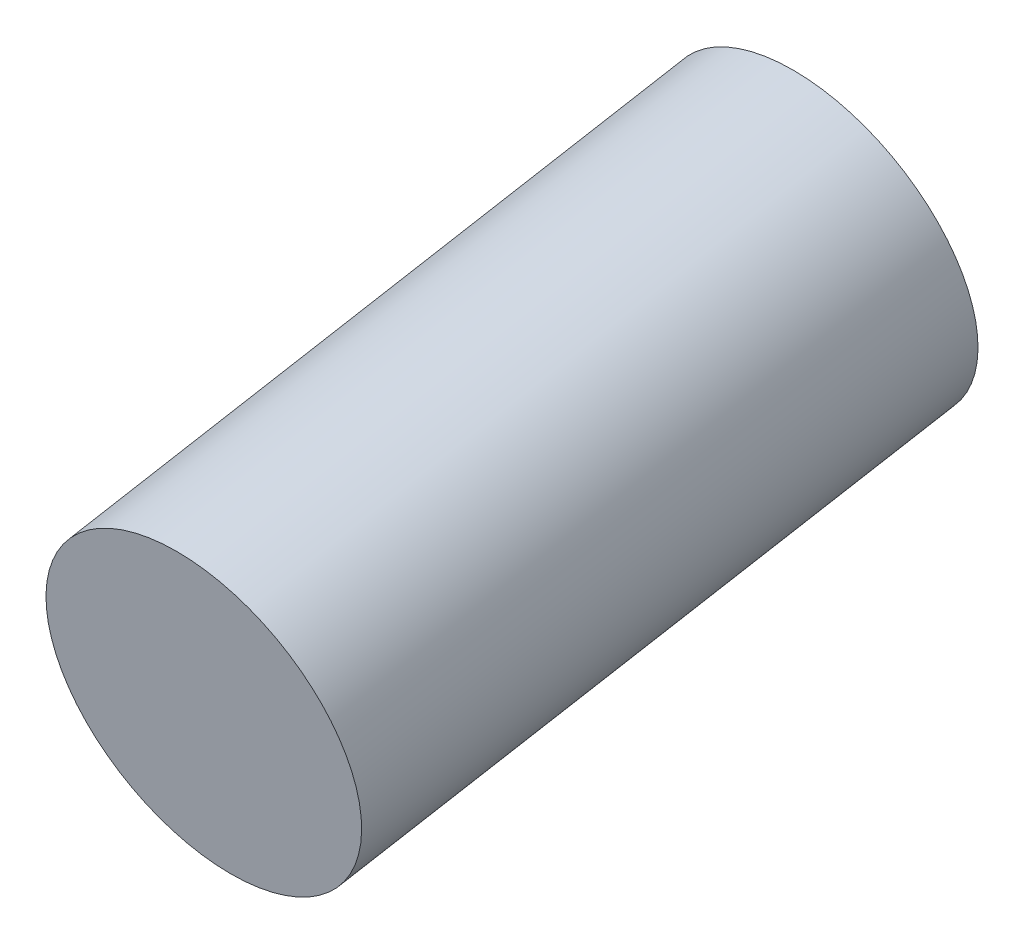
ISO-10303-21;
HEADER;
FILE_DESCRIPTION(('STEP AP214'),'2;1');
FILE_NAME('part.step','',(''),(''),'','','');
FILE_SCHEMA(('AUTOMOTIVE_DESIGN { 1 0 10303 214 1 1 1 1 }'));
ENDSEC;
DATA;
#1=APPLICATION_CONTEXT('core data for automotive mechanical design processes');
#2=APPLICATION_PROTOCOL_DEFINITION('international standard','automotive_design',2000,#1);
#3=PRODUCT_CONTEXT('',#1,'mechanical');
#4=PRODUCT('Part','Part','',(#3));
#5=PRODUCT_RELATED_PRODUCT_CATEGORY('part','',(#4));
#6=PRODUCT_DEFINITION_FORMATION('','',#4);
#7=PRODUCT_DEFINITION_CONTEXT('part definition',#1,'design');
#8=PRODUCT_DEFINITION('design','',#6,#7);
#9=PRODUCT_DEFINITION_SHAPE('','',#8);
#10=(LENGTH_UNIT() NAMED_UNIT(*) SI_UNIT(.MILLI.,.METRE.));
#11=(NAMED_UNIT(*) PLANE_ANGLE_UNIT() SI_UNIT($,.RADIAN.));
#12=(NAMED_UNIT(*) SI_UNIT($,.STERADIAN.) SOLID_ANGLE_UNIT());
#13=UNCERTAINTY_MEASURE_WITH_UNIT(LENGTH_MEASURE(1.E-05),#10,'distance_accuracy_value','');
#14=(GEOMETRIC_REPRESENTATION_CONTEXT(3) GLOBAL_UNCERTAINTY_ASSIGNED_CONTEXT((#13)) GLOBAL_UNIT_ASSIGNED_CONTEXT((#10,
#11,#12)) REPRESENTATION_CONTEXT('',''));
#15=CARTESIAN_POINT('',(0.,0.,0.));
#16=DIRECTION('',(0.,0.,1.));
#17=DIRECTION('',(1.,0.,0.));
#18=AXIS2_PLACEMENT_3D('',#15,#16,#17);
#19=CARTESIAN_POINT('',(0.,10.9265332134386,5.55625000000001));
#20=DIRECTION('',(0.,-0.173648177666927,0.984807753012209));
#21=DIRECTION('',(0.,-0.984807753012209,-0.173648177666927));
#22=AXIS2_PLACEMENT_3D('',#19,#20,#21);
#23=CYLINDRICAL_SURFACE('',#22,1.93220030269667);
#24=CARTESIAN_POINT('',(0.,11.1156843038204,4.48352085995661));
#25=DIRECTION('',(0.,-0.173648177666927,0.984807753012209));
#26=DIRECTION('',(0.,-0.984807753012209,-0.173648177666927));
#27=AXIS2_PLACEMENT_3D('',#24,#25,#26);
#28=CIRCLE('',#27,1.93220030269667);
#29=CARTESIAN_POINT('',(0.,9.21283846535218,4.14799779850585));
#30=VERTEX_POINT('',#29);
#31=EDGE_CURVE('E19',#30,#30,#28,.T.);
#32=ORIENTED_EDGE('',*,*,#31,.F.);
#33=EDGE_LOOP('',(#32));
#34=FACE_BOUND('',#33,.T.);
#35=CARTESIAN_POINT('',(0.,12.4660881637494,-3.175));
#36=DIRECTION('',(0.,-0.173648177666927,0.984807753012209));
#37=DIRECTION('',(0.,-0.984807753012209,-0.173648177666927));
#38=AXIS2_PLACEMENT_3D('',#35,#36,#37);
#39=CIRCLE('',#38,1.93220030269668);
#40=CARTESIAN_POINT('',(0.,10.5632423252812,-3.51052306145076));
#41=VERTEX_POINT('',#40);
#42=EDGE_CURVE('E10',#41,#41,#39,.T.);
#43=ORIENTED_EDGE('',*,*,#42,.T.);
#44=EDGE_LOOP('',(#43));
#45=FACE_BOUND('',#44,.T.);
#46=ADVANCED_FACE('F15',(#34,#45),#23,.T.);
#47=CARTESIAN_POINT('',(0.,11.1156843038204,4.48352085995661));
#48=DIRECTION('',(0.,0.173648177666927,-0.984807753012209));
#49=DIRECTION('',(0.,0.984807753012209,0.173648177666927));
#50=AXIS2_PLACEMENT_3D('',#47,#48,#49);
#51=PLANE('',#50);
#52=ORIENTED_EDGE('',*,*,#31,.T.);
#53=EDGE_LOOP('',(#52));
#54=FACE_BOUND('',#53,.T.);
#55=ADVANCED_FACE('F28',(#54),#51,.F.);
#56=CARTESIAN_POINT('',(0.,14.3689340022176,-2.83947693854923));
#57=DIRECTION('',(0.,-0.173648177666927,0.984807753012209));
#58=DIRECTION('',(0.,-0.984807753012209,-0.173648177666927));
#59=AXIS2_PLACEMENT_3D('',#56,#57,#58);
#60=PLANE('',#59);
#61=ORIENTED_EDGE('',*,*,#42,.F.);
#62=EDGE_LOOP('',(#61));
#63=FACE_BOUND('',#62,.T.);
#64=ADVANCED_FACE('F17',(#63),#60,.F.);
#65=CLOSED_SHELL('',(#46,#55,#64));
#66=MANIFOLD_SOLID_BREP('B1',#65);
#67=ADVANCED_BREP_SHAPE_REPRESENTATION('',(#18,#66),#14);
#68=SHAPE_DEFINITION_REPRESENTATION(#9,#67);
ENDSEC;
END-ISO-10303-21;
